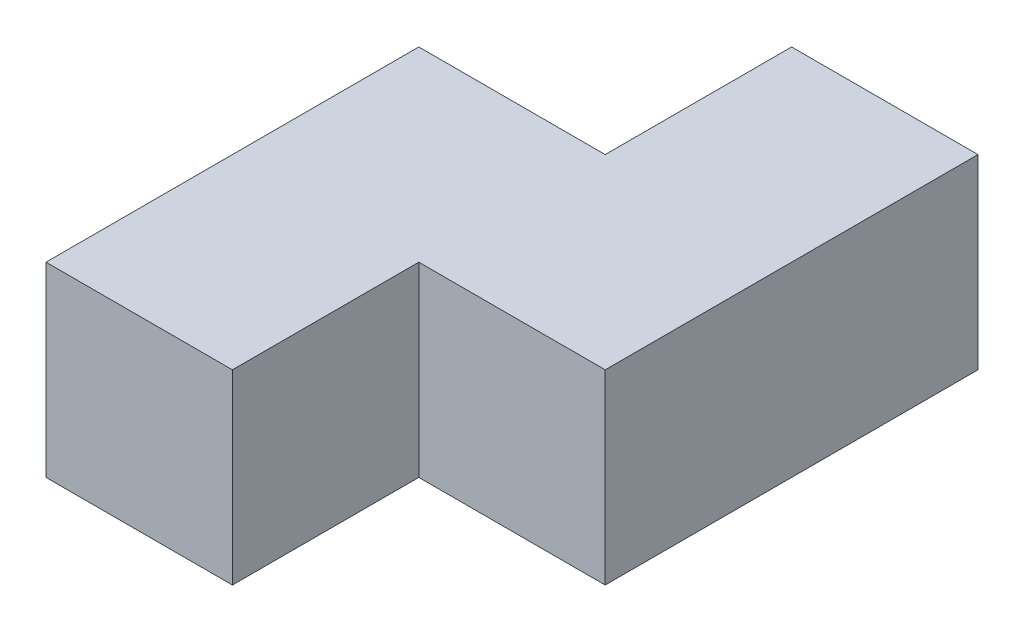
ISO-10303-21;
HEADER;
FILE_DESCRIPTION(('STEP AP214'),'2;1');
FILE_NAME('part.step','',(''),(''),'','','');
FILE_SCHEMA(('AUTOMOTIVE_DESIGN { 1 0 10303 214 1 1 1 1 }'));
ENDSEC;
DATA;
#1=APPLICATION_CONTEXT('core data for automotive mechanical design processes');
#2=APPLICATION_PROTOCOL_DEFINITION('international standard','automotive_design',2000,#1);
#3=PRODUCT_CONTEXT('',#1,'mechanical');
#4=PRODUCT('Part','Part','',(#3));
#5=PRODUCT_RELATED_PRODUCT_CATEGORY('part','',(#4));
#6=PRODUCT_DEFINITION_FORMATION('','',#4);
#7=PRODUCT_DEFINITION_CONTEXT('part definition',#1,'design');
#8=PRODUCT_DEFINITION('design','',#6,#7);
#9=PRODUCT_DEFINITION_SHAPE('','',#8);
#10=(LENGTH_UNIT() NAMED_UNIT(*) SI_UNIT(.MILLI.,.METRE.));
#11=(NAMED_UNIT(*) PLANE_ANGLE_UNIT() SI_UNIT($,.RADIAN.));
#12=(NAMED_UNIT(*) SI_UNIT($,.STERADIAN.) SOLID_ANGLE_UNIT());
#13=UNCERTAINTY_MEASURE_WITH_UNIT(LENGTH_MEASURE(1.E-05),#10,'distance_accuracy_value','');
#14=(GEOMETRIC_REPRESENTATION_CONTEXT(3) GLOBAL_UNCERTAINTY_ASSIGNED_CONTEXT((#13)) GLOBAL_UNIT_ASSIGNED_CONTEXT((#10,
#11,#12)) REPRESENTATION_CONTEXT('',''));
#15=CARTESIAN_POINT('',(0.,0.,0.));
#16=DIRECTION('',(0.,0.,1.));
#17=DIRECTION('',(1.,0.,0.));
#18=AXIS2_PLACEMENT_3D('',#15,#16,#17);
#19=CARTESIAN_POINT('',(5000.,5000.,-7500.));
#20=DIRECTION('',(0.,0.,1.));
#21=DIRECTION('',(1.,0.,0.));
#22=AXIS2_PLACEMENT_3D('',#19,#20,#21);
#23=PLANE('',#22);
#24=DIRECTION('',(-1.,0.,0.));
#25=VECTOR('',#24,1.);
#26=CARTESIAN_POINT('',(5000.,0.,-7500.));
#27=LINE('',#26,#25);
#28=CARTESIAN_POINT('',(5000.,0.,-7500.));
#29=VERTEX_POINT('',#28);
#30=CARTESIAN_POINT('',(8.88178419700126E-13,0.,-7500.));
#31=VERTEX_POINT('',#30);
#32=EDGE_CURVE('E129',#29,#31,#27,.T.);
#33=ORIENTED_EDGE('',*,*,#32,.T.);
#34=DIRECTION('',(0.,-1.,0.));
#35=VECTOR('',#34,1.);
#36=CARTESIAN_POINT('',(8.88178419700126E-13,5000.,-7500.));
#37=LINE('',#36,#35);
#38=CARTESIAN_POINT('',(8.88178419700126E-13,5000.,-7500.));
#39=VERTEX_POINT('',#38);
#40=EDGE_CURVE('E11',#39,#31,#37,.T.);
#41=ORIENTED_EDGE('',*,*,#40,.F.);
#42=DIRECTION('',(-1.,0.,0.));
#43=VECTOR('',#42,1.);
#44=CARTESIAN_POINT('',(5000.,5000.,-7500.));
#45=LINE('',#44,#43);
#46=CARTESIAN_POINT('',(5000.,5000.,-7500.));
#47=VERTEX_POINT('',#46);
#48=EDGE_CURVE('E143',#47,#39,#45,.T.);
#49=ORIENTED_EDGE('',*,*,#48,.F.);
#50=DIRECTION('',(0.,-1.,0.));
#51=VECTOR('',#50,1.);
#52=CARTESIAN_POINT('',(5000.,5000.,-7500.));
#53=LINE('',#52,#51);
#54=EDGE_CURVE('E125',#47,#29,#53,.T.);
#55=ORIENTED_EDGE('',*,*,#54,.T.);
#56=EDGE_LOOP('',(#33,#41,#49,#55));
#57=FACE_BOUND('',#56,.T.);
#58=ADVANCED_FACE('F33',(#57),#23,.F.);
#59=CARTESIAN_POINT('',(8.88178419700126E-13,5000.,-7500.));
#60=DIRECTION('',(1.,0.,0.));
#61=DIRECTION('',(0.,0.,-1.));
#62=AXIS2_PLACEMENT_3D('',#59,#60,#61);
#63=PLANE('',#62);
#64=DIRECTION('',(0.,0.,1.));
#65=VECTOR('',#64,1.);
#66=CARTESIAN_POINT('',(8.88178419700126E-13,0.,-7500.));
#67=LINE('',#66,#65);
#68=CARTESIAN_POINT('',(1.5005018192738E-12,0.,-2500.));
#69=VERTEX_POINT('',#68);
#70=EDGE_CURVE('E132',#31,#69,#67,.T.);
#71=ORIENTED_EDGE('',*,*,#70,.T.);
#72=DIRECTION('',(0.,-1.,0.));
#73=VECTOR('',#72,1.);
#74=CARTESIAN_POINT('',(1.5005018192738E-12,5000.,-2500.));
#75=LINE('',#74,#73);
#76=CARTESIAN_POINT('',(1.5005018192738E-12,5000.,-2500.));
#77=VERTEX_POINT('',#76);
#78=EDGE_CURVE('E41',#77,#69,#75,.T.);
#79=ORIENTED_EDGE('',*,*,#78,.F.);
#80=DIRECTION('',(0.,0.,1.));
#81=VECTOR('',#80,1.);
#82=CARTESIAN_POINT('',(8.88178419700126E-13,5000.,-7500.));
#83=LINE('',#82,#81);
#84=EDGE_CURVE('E92',#39,#77,#83,.T.);
#85=ORIENTED_EDGE('',*,*,#84,.F.);
#86=ORIENTED_EDGE('',*,*,#40,.T.);
#87=EDGE_LOOP('',(#71,#79,#85,#86));
#88=FACE_BOUND('',#87,.T.);
#89=ADVANCED_FACE('F178',(#88),#63,.F.);
#90=CARTESIAN_POINT('',(1.5005018192738E-12,5000.,-2500.));
#91=DIRECTION('',(0.,0.,1.));
#92=DIRECTION('',(1.,0.,0.));
#93=AXIS2_PLACEMENT_3D('',#90,#91,#92);
#94=PLANE('',#93);
#95=DIRECTION('',(-1.,0.,0.));
#96=VECTOR('',#95,1.);
#97=CARTESIAN_POINT('',(1.5005018192738E-12,0.,-2500.));
#98=LINE('',#97,#96);
#99=CARTESIAN_POINT('',(-4999.99999999999,0.,-2500.));
#100=VERTEX_POINT('',#99);
#101=EDGE_CURVE('E134',#69,#100,#98,.T.);
#102=ORIENTED_EDGE('',*,*,#101,.T.);
#103=DIRECTION('',(0.,-1.,0.));
#104=VECTOR('',#103,1.);
#105=CARTESIAN_POINT('',(-4999.99999999999,5000.,-2500.));
#106=LINE('',#105,#104);
#107=CARTESIAN_POINT('',(-4999.99999999999,5000.,-2500.));
#108=VERTEX_POINT('',#107);
#109=EDGE_CURVE('E150',#108,#100,#106,.T.);
#110=ORIENTED_EDGE('',*,*,#109,.F.);
#111=DIRECTION('',(-1.,0.,0.));
#112=VECTOR('',#111,1.);
#113=CARTESIAN_POINT('',(1.5005018192738E-12,5000.,-2500.));
#114=LINE('',#113,#112);
#115=EDGE_CURVE('E158',#77,#108,#114,.T.);
#116=ORIENTED_EDGE('',*,*,#115,.F.);
#117=ORIENTED_EDGE('',*,*,#78,.T.);
#118=EDGE_LOOP('',(#102,#110,#116,#117));
#119=FACE_BOUND('',#118,.T.);
#120=ADVANCED_FACE('F156',(#119),#94,.F.);
#121=CARTESIAN_POINT('',(-4999.99999999999,5000.,-2500.));
#122=DIRECTION('',(1.,0.,0.));
#123=DIRECTION('',(0.,0.,-1.));
#124=AXIS2_PLACEMENT_3D('',#121,#122,#123);
#125=PLANE('',#124);
#126=DIRECTION('',(0.,0.,1.));
#127=VECTOR('',#126,1.);
#128=CARTESIAN_POINT('',(-4999.99999999999,0.,-2500.));
#129=LINE('',#128,#127);
#130=CARTESIAN_POINT('',(-4999.99999999999,0.,7500.));
#131=VERTEX_POINT('',#130);
#132=EDGE_CURVE('E136',#100,#131,#129,.T.);
#133=ORIENTED_EDGE('',*,*,#132,.T.);
#134=DIRECTION('',(0.,-1.,0.));
#135=VECTOR('',#134,1.);
#136=CARTESIAN_POINT('',(-4999.99999999999,5000.,7500.));
#137=LINE('',#136,#135);
#138=CARTESIAN_POINT('',(-4999.99999999999,5000.,7500.));
#139=VERTEX_POINT('',#138);
#140=EDGE_CURVE('E147',#139,#131,#137,.T.);
#141=ORIENTED_EDGE('',*,*,#140,.F.);
#142=DIRECTION('',(0.,0.,1.));
#143=VECTOR('',#142,1.);
#144=CARTESIAN_POINT('',(-4999.99999999999,5000.,-2500.));
#145=LINE('',#144,#143);
#146=EDGE_CURVE('E170',#108,#139,#145,.T.);
#147=ORIENTED_EDGE('',*,*,#146,.F.);
#148=ORIENTED_EDGE('',*,*,#109,.T.);
#149=EDGE_LOOP('',(#133,#141,#147,#148));
#150=FACE_BOUND('',#149,.T.);
#151=ADVANCED_FACE('F166',(#150),#125,.F.);
#152=CARTESIAN_POINT('',(-4999.99999999999,5000.,7500.));
#153=DIRECTION('',(0.,0.,-1.));
#154=DIRECTION('',(-1.,0.,0.));
#155=AXIS2_PLACEMENT_3D('',#152,#153,#154);
#156=PLANE('',#155);
#157=DIRECTION('',(1.,0.,0.));
#158=VECTOR('',#157,1.);
#159=CARTESIAN_POINT('',(-4999.99999999999,0.,7500.));
#160=LINE('',#159,#158);
#161=CARTESIAN_POINT('',(8.88178419700125E-13,0.,7500.));
#162=VERTEX_POINT('',#161);
#163=EDGE_CURVE('E138',#131,#162,#160,.T.);
#164=ORIENTED_EDGE('',*,*,#163,.T.);
#165=DIRECTION('',(0.,-1.,0.));
#166=VECTOR('',#165,1.);
#167=CARTESIAN_POINT('',(8.88178419700125E-13,5000.,7500.));
#168=LINE('',#167,#166);
#169=CARTESIAN_POINT('',(8.88178419700125E-13,5000.,7500.));
#170=VERTEX_POINT('',#169);
#171=EDGE_CURVE('E120',#170,#162,#168,.T.);
#172=ORIENTED_EDGE('',*,*,#171,.F.);
#173=DIRECTION('',(1.,0.,0.));
#174=VECTOR('',#173,1.);
#175=CARTESIAN_POINT('',(-4999.99999999999,5000.,7500.));
#176=LINE('',#175,#174);
#177=EDGE_CURVE('E111',#139,#170,#176,.T.);
#178=ORIENTED_EDGE('',*,*,#177,.F.);
#179=ORIENTED_EDGE('',*,*,#140,.T.);
#180=EDGE_LOOP('',(#164,#172,#178,#179));
#181=FACE_BOUND('',#180,.T.);
#182=ADVANCED_FACE('F169',(#181),#156,.F.);
#183=CARTESIAN_POINT('',(8.88178419700125E-13,5000.,7500.));
#184=DIRECTION('',(-1.,0.,0.));
#185=DIRECTION('',(0.,0.,1.));
#186=AXIS2_PLACEMENT_3D('',#183,#184,#185);
#187=PLANE('',#186);
#188=DIRECTION('',(0.,0.,-1.));
#189=VECTOR('',#188,1.);
#190=CARTESIAN_POINT('',(8.88178419700125E-13,0.,7500.));
#191=LINE('',#190,#189);
#192=CARTESIAN_POINT('',(1.03358303286037E-12,0.,2500.));
#193=VERTEX_POINT('',#192);
#194=EDGE_CURVE('E119',#162,#193,#191,.T.);
#195=ORIENTED_EDGE('',*,*,#194,.T.);
#196=DIRECTION('',(0.,-1.,0.));
#197=VECTOR('',#196,1.);
#198=CARTESIAN_POINT('',(1.03358303286037E-12,5000.,2500.));
#199=LINE('',#198,#197);
#200=CARTESIAN_POINT('',(1.03358303286037E-12,5000.,2500.));
#201=VERTEX_POINT('',#200);
#202=EDGE_CURVE('E116',#201,#193,#199,.T.);
#203=ORIENTED_EDGE('',*,*,#202,.F.);
#204=DIRECTION('',(0.,0.,-1.));
#205=VECTOR('',#204,1.);
#206=CARTESIAN_POINT('',(8.88178419700125E-13,5000.,7500.));
#207=LINE('',#206,#205);
#208=EDGE_CURVE('E105',#170,#201,#207,.T.);
#209=ORIENTED_EDGE('',*,*,#208,.F.);
#210=ORIENTED_EDGE('',*,*,#171,.T.);
#211=EDGE_LOOP('',(#195,#203,#209,#210));
#212=FACE_BOUND('',#211,.T.);
#213=ADVANCED_FACE('F117',(#212),#187,.F.);
#214=CARTESIAN_POINT('',(1.03358303286037E-12,5000.,2500.));
#215=DIRECTION('',(0.,0.,-1.));
#216=DIRECTION('',(-1.,0.,0.));
#217=AXIS2_PLACEMENT_3D('',#214,#215,#216);
#218=PLANE('',#217);
#219=DIRECTION('',(1.,0.,0.));
#220=VECTOR('',#219,1.);
#221=CARTESIAN_POINT('',(1.03358303286037E-12,0.,2500.));
#222=LINE('',#221,#220);
#223=CARTESIAN_POINT('',(5000.,0.,2500.));
#224=VERTEX_POINT('',#223);
#225=EDGE_CURVE('E78',#193,#224,#222,.T.);
#226=ORIENTED_EDGE('',*,*,#225,.T.);
#227=DIRECTION('',(0.,-1.,0.));
#228=VECTOR('',#227,1.);
#229=CARTESIAN_POINT('',(5000.,5000.,2500.));
#230=LINE('',#229,#228);
#231=CARTESIAN_POINT('',(5000.,5000.,2500.));
#232=VERTEX_POINT('',#231);
#233=EDGE_CURVE('E121',#232,#224,#230,.T.);
#234=ORIENTED_EDGE('',*,*,#233,.F.);
#235=DIRECTION('',(1.,0.,0.));
#236=VECTOR('',#235,1.);
#237=CARTESIAN_POINT('',(1.03358303286037E-12,5000.,2500.));
#238=LINE('',#237,#236);
#239=EDGE_CURVE('E109',#201,#232,#238,.T.);
#240=ORIENTED_EDGE('',*,*,#239,.F.);
#241=ORIENTED_EDGE('',*,*,#202,.T.);
#242=EDGE_LOOP('',(#226,#234,#240,#241));
#243=FACE_BOUND('',#242,.T.);
#244=ADVANCED_FACE('F123',(#243),#218,.F.);
#245=CARTESIAN_POINT('',(5000.,5000.,2500.));
#246=DIRECTION('',(-1.,0.,0.));
#247=DIRECTION('',(0.,0.,1.));
#248=AXIS2_PLACEMENT_3D('',#245,#246,#247);
#249=PLANE('',#248);
#250=DIRECTION('',(0.,0.,-1.));
#251=VECTOR('',#250,1.);
#252=CARTESIAN_POINT('',(5000.,0.,2500.));
#253=LINE('',#252,#251);
#254=EDGE_CURVE('E84',#224,#29,#253,.T.);
#255=ORIENTED_EDGE('',*,*,#254,.T.);
#256=ORIENTED_EDGE('',*,*,#54,.F.);
#257=DIRECTION('',(0.,0.,-1.));
#258=VECTOR('',#257,1.);
#259=CARTESIAN_POINT('',(5000.,5000.,2500.));
#260=LINE('',#259,#258);
#261=EDGE_CURVE('E49',#232,#47,#260,.T.);
#262=ORIENTED_EDGE('',*,*,#261,.F.);
#263=ORIENTED_EDGE('',*,*,#233,.T.);
#264=EDGE_LOOP('',(#255,#256,#262,#263));
#265=FACE_BOUND('',#264,.T.);
#266=ADVANCED_FACE('F194',(#265),#249,.F.);
#267=CARTESIAN_POINT('',(0.,5000.,0.));
#268=DIRECTION('',(0.,1.,0.));
#269=DIRECTION('',(0.,0.,1.));
#270=AXIS2_PLACEMENT_3D('',#267,#268,#269);
#271=PLANE('',#270);
#272=ORIENTED_EDGE('',*,*,#48,.T.);
#273=ORIENTED_EDGE('',*,*,#84,.T.);
#274=ORIENTED_EDGE('',*,*,#115,.T.);
#275=ORIENTED_EDGE('',*,*,#146,.T.);
#276=ORIENTED_EDGE('',*,*,#177,.T.);
#277=ORIENTED_EDGE('',*,*,#208,.T.);
#278=ORIENTED_EDGE('',*,*,#239,.T.);
#279=ORIENTED_EDGE('',*,*,#261,.T.);
#280=EDGE_LOOP('',(#272,#273,#274,#275,#276,#277,#278,#279));
#281=FACE_BOUND('',#280,.T.);
#282=ADVANCED_FACE('F107',(#281),#271,.T.);
#283=CARTESIAN_POINT('',(0.,0.,0.));
#284=DIRECTION('',(0.,1.,0.));
#285=DIRECTION('',(0.,0.,1.));
#286=AXIS2_PLACEMENT_3D('',#283,#284,#285);
#287=PLANE('',#286);
#288=ORIENTED_EDGE('',*,*,#32,.F.);
#289=ORIENTED_EDGE('',*,*,#254,.F.);
#290=ORIENTED_EDGE('',*,*,#225,.F.);
#291=ORIENTED_EDGE('',*,*,#194,.F.);
#292=ORIENTED_EDGE('',*,*,#163,.F.);
#293=ORIENTED_EDGE('',*,*,#132,.F.);
#294=ORIENTED_EDGE('',*,*,#101,.F.);
#295=ORIENTED_EDGE('',*,*,#70,.F.);
#296=EDGE_LOOP('',(#288,#289,#290,#291,#292,#293,#294,#295));
#297=FACE_BOUND('',#296,.T.);
#298=ADVANCED_FACE('F162',(#297),#287,.F.);
#299=CLOSED_SHELL('',(#58,#89,#120,#151,#182,#213,#244,#266,#282,#298));
#300=MANIFOLD_SOLID_BREP('B2',#299);
#301=ADVANCED_BREP_SHAPE_REPRESENTATION('',(#18,#300),#14);
#302=SHAPE_DEFINITION_REPRESENTATION(#9,#301);
ENDSEC;
END-ISO-10303-21;
